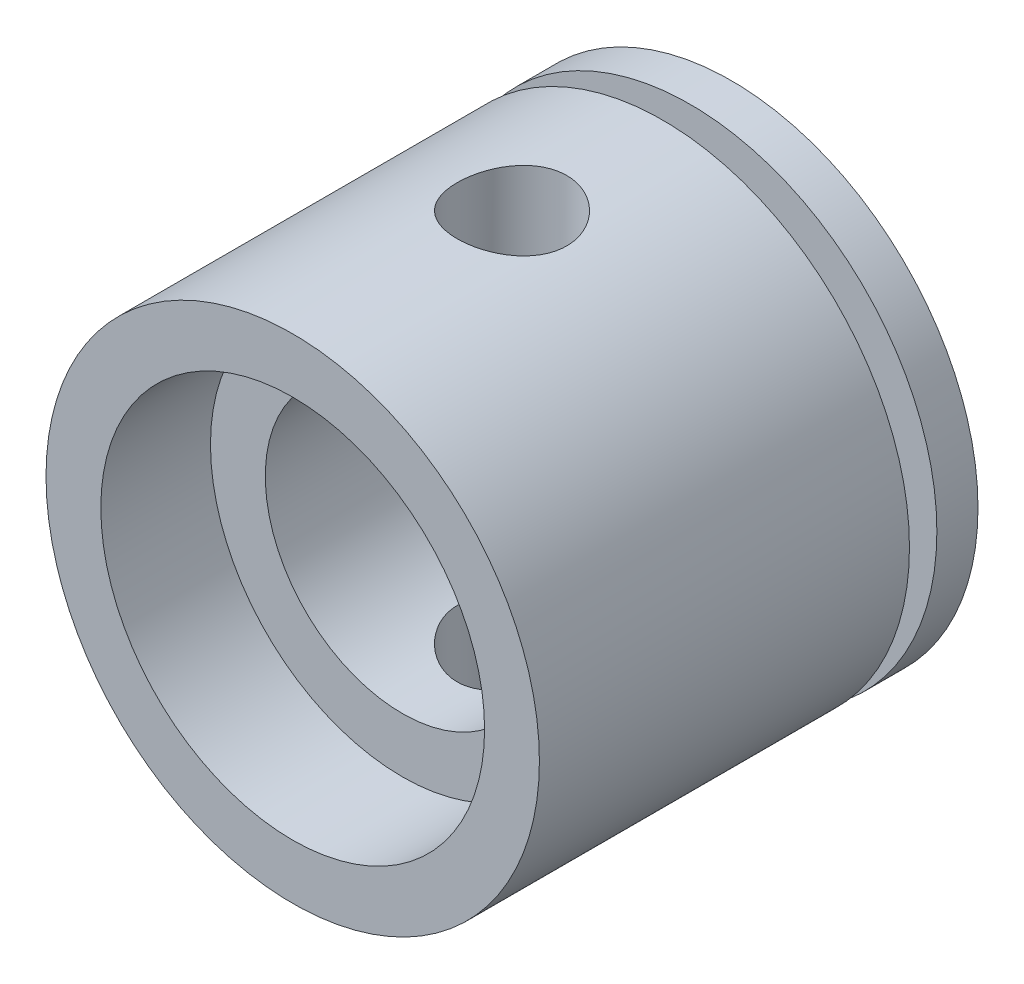
ISO-10303-21;
HEADER;
FILE_DESCRIPTION(('STEP AP214'),'2;1');
FILE_NAME('part.step','',(''),(''),'','','');
FILE_SCHEMA(('AUTOMOTIVE_DESIGN { 1 0 10303 214 1 1 1 1 }'));
ENDSEC;
DATA;
#1=APPLICATION_CONTEXT('core data for automotive mechanical design processes');
#2=APPLICATION_PROTOCOL_DEFINITION('international standard','automotive_design',2000,#1);
#3=PRODUCT_CONTEXT('',#1,'mechanical');
#4=PRODUCT('Part','Part','',(#3));
#5=PRODUCT_RELATED_PRODUCT_CATEGORY('part','',(#4));
#6=PRODUCT_DEFINITION_FORMATION('','',#4);
#7=PRODUCT_DEFINITION_CONTEXT('part definition',#1,'design');
#8=PRODUCT_DEFINITION('design','',#6,#7);
#9=PRODUCT_DEFINITION_SHAPE('','',#8);
#10=(LENGTH_UNIT() NAMED_UNIT(*) SI_UNIT(.MILLI.,.METRE.));
#11=(NAMED_UNIT(*) PLANE_ANGLE_UNIT() SI_UNIT($,.RADIAN.));
#12=(NAMED_UNIT(*) SI_UNIT($,.STERADIAN.) SOLID_ANGLE_UNIT());
#13=UNCERTAINTY_MEASURE_WITH_UNIT(LENGTH_MEASURE(1.E-05),#10,'distance_accuracy_value','');
#14=(GEOMETRIC_REPRESENTATION_CONTEXT(3) GLOBAL_UNCERTAINTY_ASSIGNED_CONTEXT((#13)) GLOBAL_UNIT_ASSIGNED_CONTEXT((#10,
#11,#12)) REPRESENTATION_CONTEXT('',''));
#15=CARTESIAN_POINT('',(0.,0.,0.));
#16=DIRECTION('',(0.,0.,1.));
#17=DIRECTION('',(1.,0.,0.));
#18=AXIS2_PLACEMENT_3D('',#15,#16,#17);
#19=CARTESIAN_POINT('',(0.,0.,16.));
#20=DIRECTION('',(0.,0.,-1.));
#21=DIRECTION('',(-1.,0.,0.));
#22=AXIS2_PLACEMENT_3D('',#19,#20,#21);
#23=CYLINDRICAL_SURFACE('',#22,9.);
#24=CARTESIAN_POINT('',(0.,-9.,10.));
#25=CARTESIAN_POINT('',(0.110880476775648,-8.99999796218252,9.99999627632018));
#26=CARTESIAN_POINT('',(0.22180556526962,-8.99793013995692,9.99074801833651));
#27=CARTESIAN_POINT('',(0.440501944103134,-8.9898809775767,9.95403952764945));
#28=CARTESIAN_POINT('',(0.548270975138987,-8.98389690217348,9.92656656599071));
#29=CARTESIAN_POINT('',(0.757463277761528,-8.96868113169008,9.85431402950835));
#30=CARTESIAN_POINT('',(0.858893152100284,-8.95945288439083,9.80955282300213));
#31=CARTESIAN_POINT('',(1.05280018031376,-8.93874335441378,9.7040533875276));
#32=CARTESIAN_POINT('',(1.14527750793335,-8.92726211547358,9.64331546870939));
#33=CARTESIAN_POINT('',(1.32018631401403,-8.9030909417421,9.50652433489332));
#34=CARTESIAN_POINT('',(1.40244861204353,-8.89038561641427,9.43025749786486));
#35=CARTESIAN_POINT('',(1.55312491045837,-8.86530601079787,9.26503193990686));
#36=CARTESIAN_POINT('',(1.62153764410855,-8.85293176088049,9.17607205928954));
#37=CARTESIAN_POINT('',(1.7433244341035,-8.82976328261711,8.9867281559417));
#38=CARTESIAN_POINT('',(1.79651742104403,-8.81898875742981,8.88622504195847));
#39=CARTESIAN_POINT('',(1.88519298954508,-8.80046096352395,8.67742723830758));
#40=CARTESIAN_POINT('',(1.92067776220096,-8.79270732104771,8.56913351449575));
#41=CARTESIAN_POINT('',(1.97236858006404,-8.78125609459189,8.34966652267734));
#42=CARTESIAN_POINT('',(1.98887467038069,-8.77749545807783,8.23856728489457));
#43=CARTESIAN_POINT('',(2.00307270997673,-8.77426673730669,8.0151177822138));
#44=CARTESIAN_POINT('',(2.00076704911663,-8.77479810778939,7.90276767803785));
#45=CARTESIAN_POINT('',(1.97764827517302,-8.78003632148146,7.6822433728062));
#46=CARTESIAN_POINT('',(1.95718464460217,-8.78466431384841,7.57403037586066));
#47=CARTESIAN_POINT('',(1.89888490681146,-8.79744954191676,7.362612856675));
#48=CARTESIAN_POINT('',(1.86104779681652,-8.80560698133176,7.2594086239146));
#49=CARTESIAN_POINT('',(1.76875672872875,-8.82460909970296,7.05996056161812));
#50=CARTESIAN_POINT('',(1.71416919379353,-8.8354752436249,6.96378067266393));
#51=CARTESIAN_POINT('',(1.5900206813985,-8.85865737910744,6.78181712948411));
#52=CARTESIAN_POINT('',(1.52045760074274,-8.87097357420597,6.69603493817985));
#53=CARTESIAN_POINT('',(1.36648683702983,-8.89600574612666,6.53529069065153));
#54=CARTESIAN_POINT('',(1.28178220526623,-8.90872450687872,6.46061321489494));
#55=CARTESIAN_POINT('',(1.10090661809162,-8.93287839122317,6.32647627109288));
#56=CARTESIAN_POINT('',(1.00473544183737,-8.94431349008427,6.2670170962181));
#57=CARTESIAN_POINT('',(0.803303190734735,-8.96465064233607,6.16493072422319));
#58=CARTESIAN_POINT('',(0.698022122319854,-8.97354693007659,6.12234175569174));
#59=CARTESIAN_POINT('',(0.481555930981457,-8.98776136366255,6.05553898694213));
#60=CARTESIAN_POINT('',(0.370371697593366,-8.99308004696785,6.03132242658587));
#61=CARTESIAN_POINT('',(0.147695483280845,-8.99946317761673,6.00236798674483));
#62=CARTESIAN_POINT('',(0.0362563973189056,-9.0006124862229,5.99724149983832));
#63=CARTESIAN_POINT('',(-0.185885923928079,-8.99876558650597,6.00555810426037));
#64=CARTESIAN_POINT('',(-0.296589210270645,-8.9957696689046,6.01899989331945));
#65=CARTESIAN_POINT('',(-0.512823257329421,-8.98602258758613,6.0637494151681));
#66=CARTESIAN_POINT('',(-0.618398491715483,-8.97931447007761,6.09485245622345));
#67=CARTESIAN_POINT('',(-0.822832805855831,-8.96289421086795,6.17381368744508));
#68=CARTESIAN_POINT('',(-0.921691300010177,-8.95318180764659,6.22167333630601));
#69=CARTESIAN_POINT('',(-1.11148643989438,-8.9316215322764,6.33359287679898));
#70=CARTESIAN_POINT('',(-1.20228573083225,-8.91974444590247,6.39787994300616));
#71=CARTESIAN_POINT('',(-1.37194696498812,-8.8952303234908,6.54053124910144));
#72=CARTESIAN_POINT('',(-1.45080730173413,-8.88259318550175,6.6188973803321));
#73=CARTESIAN_POINT('',(-1.59589548190985,-8.8576887894581,6.7892680335807));
#74=CARTESIAN_POINT('',(-1.66185381940073,-8.84543317664284,6.8815040900066));
#75=CARTESIAN_POINT('',(-1.77734611922752,-8.82295395378309,7.07597203441081));
#76=CARTESIAN_POINT('',(-1.82688079926974,-8.8127302549527,7.1782034853421));
#77=CARTESIAN_POINT('',(-1.90778001896259,-8.79557200548926,7.38920828910514));
#78=CARTESIAN_POINT('',(-1.93924786354759,-8.78861879659787,7.49794044226884));
#79=CARTESIAN_POINT('',(-1.98342027658406,-8.77875649697392,7.71932418486247));
#80=CARTESIAN_POINT('',(-1.99612795718356,-8.77584673547331,7.83197512102595));
#81=CARTESIAN_POINT('',(-2.00228356641044,-8.77444401448977,8.05527887827833));
#82=CARTESIAN_POINT('',(-1.99615913143933,-8.77585298370124,8.16591950806006));
#83=CARTESIAN_POINT('',(-1.96578277121688,-8.78270664957547,8.38454970996682));
#84=CARTESIAN_POINT('',(-1.94153107400239,-8.78815129547033,8.49253931542348));
#85=CARTESIAN_POINT('',(-1.87579819980744,-8.80241428131525,8.70244912022738));
#86=CARTESIAN_POINT('',(-1.83438116628454,-8.81122005182769,8.80439031688159));
#87=CARTESIAN_POINT('',(-1.73554770348342,-8.83121764469058,8.99993999254673));
#88=CARTESIAN_POINT('',(-1.67812954585194,-8.84240972476633,9.09354756996401));
#89=CARTESIAN_POINT('',(-1.54751358990558,-8.8662104283533,9.27187660894797));
#90=CARTESIAN_POINT('',(-1.47401185511038,-8.8788437136774,9.35637220492265));
#91=CARTESIAN_POINT('',(-1.31392870594504,-8.90393974173387,9.51197007393133));
#92=CARTESIAN_POINT('',(-1.22734426623344,-8.91640244429053,9.58306924050841));
#93=CARTESIAN_POINT('',(-1.04214597064557,-8.93995259726581,9.71077598291992));
#94=CARTESIAN_POINT('',(-0.943385636634949,-8.95101923499229,9.76717519973493));
#95=CARTESIAN_POINT('',(-0.737560279778818,-8.97032058369249,9.86248330418121));
#96=CARTESIAN_POINT('',(-0.630502203312995,-8.97855763270815,9.90140664004617));
#97=CARTESIAN_POINT('',(-0.436138247729409,-8.98982812909554,9.95384135027679));
#98=CARTESIAN_POINT('',(-0.349871991901681,-8.9936186902321,9.97111737366629));
#99=CARTESIAN_POINT('',(-0.175746449894528,-8.99870537459789,9.99419790430615));
#100=CARTESIAN_POINT('',(-0.087887238892878,-9.00000161523613,10.0000029515019));
#101=CARTESIAN_POINT('',(0.,-9.,10.));
#102=B_SPLINE_CURVE_WITH_KNOTS('',3,(#24,#25,#26,#27,#28,#29,#30,#31,#32,#33,#34,#35,#36,#37,
#38,#39,#40,#41,#42,#43,#44,#45,#46,#47,#48,#49,#50,#51,#52,#53,#54,#55,#56,#57,#58,#59,#60,#61,
#62,#63,#64,#65,#66,#67,#68,#69,#70,#71,#72,#73,#74,#75,#76,#77,#78,#79,#80,#81,#82,#83,#84,#85,
#86,#87,#88,#89,#90,#91,#92,#93,#94,#95,#96,#97,#98,#99,#100,#101),.UNSPECIFIED.,.T.,.F.,(4,2,2,
2,2,2,2,2,2,2,2,2,2,2,2,2,2,2,2,2,2,2,2,2,2,2,2,2,2,2,2,2,2,2,2,2,2,2,4),(0.,0.332319689729797,
0.664871731249283,0.997071412407458,1.32926464516989,1.66638072002079,2.00352761490514,
2.34453296297976,2.6854961068774,3.02099125638107,3.35644378496591,3.68557668145783,
4.0147285774694,4.34657669709581,4.678471452583,5.01778179808977,5.35709867969827,
5.69718012811237,6.03721047501988,6.37027992124269,6.70332600912267,7.03258869425167,
7.36188004945459,7.69599803262041,8.03016093387756,8.37069473105728,8.71121364510411,
9.04976559055244,9.38826136686411,9.71912785142416,10.0499901738286,10.3796271201578,
10.7092996858639,11.0458432631282,11.3824647846641,11.7236258704957,12.0645043787094,
12.3279234735856,12.5913301688795),.UNSPECIFIED.);
#103=CARTESIAN_POINT('',(0.,-9.,10.));
#104=VERTEX_POINT('',#103);
#105=EDGE_CURVE('E77',#104,#104,#102,.T.);
#106=ORIENTED_EDGE('',*,*,#105,.T.);
#107=EDGE_LOOP('',(#106));
#108=FACE_BOUND('',#107,.T.);
#109=CARTESIAN_POINT('',(0.,9.,10.));
#110=CARTESIAN_POINT('',(-0.110880476775648,8.99999796218252,9.99999627632018));
#111=CARTESIAN_POINT('',(-0.22180556526962,8.99793013995692,9.99074801833651));
#112=CARTESIAN_POINT('',(-0.440501944103134,8.9898809775767,9.95403952764945));
#113=CARTESIAN_POINT('',(-0.548270975138987,8.98389690217348,9.92656656599071));
#114=CARTESIAN_POINT('',(-0.757463277761528,8.96868113169008,9.85431402950835));
#115=CARTESIAN_POINT('',(-0.858893152100284,8.95945288439083,9.80955282300213));
#116=CARTESIAN_POINT('',(-1.05280018031376,8.93874335441378,9.7040533875276));
#117=CARTESIAN_POINT('',(-1.14527750793335,8.92726211547358,9.64331546870939));
#118=CARTESIAN_POINT('',(-1.32018631401403,8.9030909417421,9.50652433489332));
#119=CARTESIAN_POINT('',(-1.40244861204353,8.89038561641427,9.43025749786486));
#120=CARTESIAN_POINT('',(-1.55312491045837,8.86530601079787,9.26503193990686));
#121=CARTESIAN_POINT('',(-1.62153764410855,8.85293176088049,9.17607205928954));
#122=CARTESIAN_POINT('',(-1.7433244341035,8.82976328261711,8.9867281559417));
#123=CARTESIAN_POINT('',(-1.79651742104403,8.81898875742981,8.88622504195847));
#124=CARTESIAN_POINT('',(-1.88519298954508,8.80046096352395,8.67742723830758));
#125=CARTESIAN_POINT('',(-1.92067776220096,8.79270732104771,8.56913351449575));
#126=CARTESIAN_POINT('',(-1.97236858006404,8.78125609459189,8.34966652267734));
#127=CARTESIAN_POINT('',(-1.98887467038069,8.77749545807783,8.23856728489457));
#128=CARTESIAN_POINT('',(-2.00307270997673,8.77426673730669,8.0151177822138));
#129=CARTESIAN_POINT('',(-2.00076704911663,8.77479810778939,7.90276767803785));
#130=CARTESIAN_POINT('',(-1.97764827517302,8.78003632148146,7.6822433728062));
#131=CARTESIAN_POINT('',(-1.95718464460217,8.78466431384841,7.57403037586066));
#132=CARTESIAN_POINT('',(-1.89888490681146,8.79744954191676,7.362612856675));
#133=CARTESIAN_POINT('',(-1.86104779681652,8.80560698133176,7.2594086239146));
#134=CARTESIAN_POINT('',(-1.76875672872875,8.82460909970296,7.05996056161812));
#135=CARTESIAN_POINT('',(-1.71416919379353,8.8354752436249,6.96378067266393));
#136=CARTESIAN_POINT('',(-1.5900206813985,8.85865737910744,6.78181712948411));
#137=CARTESIAN_POINT('',(-1.52045760074274,8.87097357420597,6.69603493817985));
#138=CARTESIAN_POINT('',(-1.36648683702983,8.89600574612666,6.53529069065153));
#139=CARTESIAN_POINT('',(-1.28178220526623,8.90872450687872,6.46061321489494));
#140=CARTESIAN_POINT('',(-1.10090661809162,8.93287839122317,6.32647627109288));
#141=CARTESIAN_POINT('',(-1.00473544183737,8.94431349008427,6.2670170962181));
#142=CARTESIAN_POINT('',(-0.803303190734735,8.96465064233607,6.16493072422319));
#143=CARTESIAN_POINT('',(-0.698022122319854,8.97354693007659,6.12234175569174));
#144=CARTESIAN_POINT('',(-0.481555930981457,8.98776136366255,6.05553898694213));
#145=CARTESIAN_POINT('',(-0.370371697593366,8.99308004696785,6.03132242658587));
#146=CARTESIAN_POINT('',(-0.147695483280845,8.99946317761673,6.00236798674483));
#147=CARTESIAN_POINT('',(-0.0362563973189056,9.0006124862229,5.99724149983832));
#148=CARTESIAN_POINT('',(0.185885923928079,8.99876558650597,6.00555810426037));
#149=CARTESIAN_POINT('',(0.296589210270645,8.9957696689046,6.01899989331945));
#150=CARTESIAN_POINT('',(0.512823257329421,8.98602258758613,6.0637494151681));
#151=CARTESIAN_POINT('',(0.618398491715483,8.97931447007761,6.09485245622345));
#152=CARTESIAN_POINT('',(0.822832805855831,8.96289421086795,6.17381368744508));
#153=CARTESIAN_POINT('',(0.921691300010177,8.95318180764659,6.22167333630601));
#154=CARTESIAN_POINT('',(1.11148643989438,8.9316215322764,6.33359287679898));
#155=CARTESIAN_POINT('',(1.20228573083225,8.91974444590247,6.39787994300616));
#156=CARTESIAN_POINT('',(1.37194696498812,8.8952303234908,6.54053124910144));
#157=CARTESIAN_POINT('',(1.45080730173413,8.88259318550175,6.6188973803321));
#158=CARTESIAN_POINT('',(1.59589548190985,8.8576887894581,6.7892680335807));
#159=CARTESIAN_POINT('',(1.66185381940073,8.84543317664284,6.8815040900066));
#160=CARTESIAN_POINT('',(1.77734611922752,8.82295395378309,7.07597203441081));
#161=CARTESIAN_POINT('',(1.82688079926974,8.8127302549527,7.1782034853421));
#162=CARTESIAN_POINT('',(1.90778001896259,8.79557200548926,7.38920828910514));
#163=CARTESIAN_POINT('',(1.93924786354759,8.78861879659787,7.49794044226884));
#164=CARTESIAN_POINT('',(1.98342027658406,8.77875649697392,7.71932418486247));
#165=CARTESIAN_POINT('',(1.99612795718356,8.77584673547331,7.83197512102595));
#166=CARTESIAN_POINT('',(2.00228356641044,8.77444401448977,8.05527887827833));
#167=CARTESIAN_POINT('',(1.99615913143933,8.77585298370124,8.16591950806006));
#168=CARTESIAN_POINT('',(1.96578277121688,8.78270664957547,8.38454970996682));
#169=CARTESIAN_POINT('',(1.94153107400239,8.78815129547033,8.49253931542348));
#170=CARTESIAN_POINT('',(1.87579819980744,8.80241428131525,8.70244912022738));
#171=CARTESIAN_POINT('',(1.83438116628454,8.81122005182769,8.80439031688159));
#172=CARTESIAN_POINT('',(1.73554770348342,8.83121764469058,8.99993999254673));
#173=CARTESIAN_POINT('',(1.67812954585194,8.84240972476633,9.09354756996401));
#174=CARTESIAN_POINT('',(1.54751358990558,8.8662104283533,9.27187660894797));
#175=CARTESIAN_POINT('',(1.47401185511038,8.8788437136774,9.35637220492265));
#176=CARTESIAN_POINT('',(1.31392870594504,8.90393974173387,9.51197007393133));
#177=CARTESIAN_POINT('',(1.22734426623344,8.91640244429053,9.58306924050841));
#178=CARTESIAN_POINT('',(1.04214597064557,8.93995259726581,9.71077598291992));
#179=CARTESIAN_POINT('',(0.943385636634949,8.95101923499229,9.76717519973493));
#180=CARTESIAN_POINT('',(0.737560279778818,8.97032058369249,9.86248330418121));
#181=CARTESIAN_POINT('',(0.630502203312995,8.97855763270815,9.90140664004617));
#182=CARTESIAN_POINT('',(0.436138247729409,8.98982812909554,9.95384135027679));
#183=CARTESIAN_POINT('',(0.349871991901681,8.9936186902321,9.97111737366629));
#184=CARTESIAN_POINT('',(0.175746449894528,8.99870537459789,9.99419790430615));
#185=CARTESIAN_POINT('',(0.087887238892878,9.00000161523613,10.0000029515019));
#186=CARTESIAN_POINT('',(0.,9.,10.));
#187=B_SPLINE_CURVE_WITH_KNOTS('',3,(#109,#110,#111,#112,#113,#114,#115,#116,#117,#118,#119,
#120,#121,#122,#123,#124,#125,#126,#127,#128,#129,#130,#131,#132,#133,#134,#135,#136,#137,#138,
#139,#140,#141,#142,#143,#144,#145,#146,#147,#148,#149,#150,#151,#152,#153,#154,#155,#156,#157,
#158,#159,#160,#161,#162,#163,#164,#165,#166,#167,#168,#169,#170,#171,#172,#173,#174,#175,#176,
#177,#178,#179,#180,#181,#182,#183,#184,#185,#186),.UNSPECIFIED.,.T.,.F.,(4,2,2,2,2,2,2,2,2,2,2,
2,2,2,2,2,2,2,2,2,2,2,2,2,2,2,2,2,2,2,2,2,2,2,2,2,2,2,4),(0.,0.332319689729797,
0.664871731249283,0.997071412407458,1.32926464516989,1.66638072002079,2.00352761490514,
2.34453296297976,2.6854961068774,3.02099125638107,3.35644378496591,3.68557668145783,
4.0147285774694,4.34657669709581,4.678471452583,5.01778179808977,5.35709867969827,
5.69718012811237,6.03721047501988,6.37027992124269,6.70332600912267,7.03258869425167,
7.36188004945459,7.69599803262041,8.03016093387756,8.37069473105728,8.71121364510411,
9.04976559055244,9.38826136686411,9.71912785142416,10.0499901738286,10.3796271201578,
10.7092996858639,11.0458432631282,11.3824647846641,11.7236258704957,12.0645043787094,
12.3279234735856,12.5913301688795),.UNSPECIFIED.);
#188=CARTESIAN_POINT('',(0.,9.,10.));
#189=VERTEX_POINT('',#188);
#190=EDGE_CURVE('E73',#189,#189,#187,.T.);
#191=ORIENTED_EDGE('',*,*,#190,.T.);
#192=EDGE_LOOP('',(#191));
#193=FACE_BOUND('',#192,.T.);
#194=CARTESIAN_POINT('',(0.,0.,2.5));
#195=DIRECTION('',(0.,0.,1.));
#196=DIRECTION('',(1.,0.,0.));
#197=AXIS2_PLACEMENT_3D('',#194,#195,#196);
#198=CIRCLE('',#197,9.);
#199=CARTESIAN_POINT('',(9.,0.,2.5));
#200=VERTEX_POINT('',#199);
#201=EDGE_CURVE('E86',#200,#200,#198,.T.);
#202=ORIENTED_EDGE('',*,*,#201,.T.);
#203=EDGE_LOOP('',(#202));
#204=FACE_BOUND('',#203,.T.);
#205=CARTESIAN_POINT('',(0.,0.,16.));
#206=DIRECTION('',(0.,0.,1.));
#207=DIRECTION('',(1.,0.,0.));
#208=AXIS2_PLACEMENT_3D('',#205,#206,#207);
#209=CIRCLE('',#208,9.);
#210=CARTESIAN_POINT('',(9.,0.,16.));
#211=VERTEX_POINT('',#210);
#212=EDGE_CURVE('E10',#211,#211,#209,.T.);
#213=ORIENTED_EDGE('',*,*,#212,.F.);
#214=EDGE_LOOP('',(#213));
#215=FACE_BOUND('',#214,.T.);
#216=ADVANCED_FACE('F31',(#108,#193,#204,#215),#23,.T.);
#217=CARTESIAN_POINT('',(0.,0.,16.));
#218=DIRECTION('',(0.,0.,1.));
#219=DIRECTION('',(1.,0.,0.));
#220=AXIS2_PLACEMENT_3D('',#217,#218,#219);
#221=PLANE('',#220);
#222=CARTESIAN_POINT('',(0.,0.,16.));
#223=DIRECTION('',(0.,0.,1.));
#224=DIRECTION('',(1.,0.,0.));
#225=AXIS2_PLACEMENT_3D('',#222,#223,#224);
#226=CIRCLE('',#225,7.);
#227=CARTESIAN_POINT('',(7.,0.,16.));
#228=VERTEX_POINT('',#227);
#229=EDGE_CURVE('E92',#228,#228,#226,.T.);
#230=ORIENTED_EDGE('',*,*,#229,.F.);
#231=EDGE_LOOP('',(#230));
#232=FACE_BOUND('',#231,.T.);
#233=ORIENTED_EDGE('',*,*,#212,.T.);
#234=EDGE_LOOP('',(#233));
#235=FACE_BOUND('',#234,.T.);
#236=ADVANCED_FACE('F117',(#232,#235),#221,.T.);
#237=CARTESIAN_POINT('',(0.,0.,2.));
#238=DIRECTION('',(0.,0.,-1.));
#239=DIRECTION('',(-1.,0.,0.));
#240=AXIS2_PLACEMENT_3D('',#237,#238,#239);
#241=PLANE('',#240);
#242=CARTESIAN_POINT('',(0.,0.,2.));
#243=DIRECTION('',(0.,0.,1.));
#244=DIRECTION('',(1.,0.,0.));
#245=AXIS2_PLACEMENT_3D('',#242,#243,#244);
#246=CIRCLE('',#245,5.);
#247=CARTESIAN_POINT('',(5.,0.,2.));
#248=VERTEX_POINT('',#247);
#249=EDGE_CURVE('E48',#248,#248,#246,.T.);
#250=ORIENTED_EDGE('',*,*,#249,.T.);
#251=EDGE_LOOP('',(#250));
#252=FACE_BOUND('',#251,.T.);
#253=ADVANCED_FACE('F106',(#252),#241,.F.);
#254=CARTESIAN_POINT('',(0.,0.,16.));
#255=DIRECTION('',(0.,0.,1.));
#256=DIRECTION('',(1.,0.,0.));
#257=AXIS2_PLACEMENT_3D('',#254,#255,#256);
#258=CYLINDRICAL_SURFACE('',#257,5.);
#259=CARTESIAN_POINT('',(0.,-5.,10.));
#260=CARTESIAN_POINT('',(-0.107493005442891,-4.99999271227084,9.99999014817627));
#261=CARTESIAN_POINT('',(-0.215172564090673,-4.99649294306932,9.99128224791162));
#262=CARTESIAN_POINT('',(-0.427496480417896,-4.98283453100641,9.95675229647876));
#263=CARTESIAN_POINT('',(-0.532131777561248,-4.97265778698877,9.93088372091387));
#264=CARTESIAN_POINT('',(-0.734953922727403,-4.94674209213118,9.86312392194117));
#265=CARTESIAN_POINT('',(-0.833160661616958,-4.93102136364072,9.82128515378327));
#266=CARTESIAN_POINT('',(-1.02107197032837,-4.89556610796078,9.72298082667345));
#267=CARTESIAN_POINT('',(-1.11077947675099,-4.87583297458056,9.66652034508107));
#268=CARTESIAN_POINT('',(-1.28350100757039,-4.83330886170418,9.53776450143906));
#269=CARTESIAN_POINT('',(-1.36606227255021,-4.8104229692919,9.46489334375974));
#270=CARTESIAN_POINT('',(-1.51817500478472,-4.76460576906194,9.30659999652322));
#271=CARTESIAN_POINT('',(-1.58772010713353,-4.74167444453792,9.22117170278826));
#272=CARTESIAN_POINT('',(-1.71487456729288,-4.69722791797136,9.03557192975773));
#273=CARTESIAN_POINT('',(-1.77181498119547,-4.67582115964951,8.9349135139768));
#274=CARTESIAN_POINT('',(-1.86775471903715,-4.63833647186792,8.72446360157996));
#275=CARTESIAN_POINT('',(-1.90676256428583,-4.62225601244176,8.61467647215164));
#276=CARTESIAN_POINT('',(-1.96389882339587,-4.59826357660818,8.3942876664079));
#277=CARTESIAN_POINT('',(-1.98289396580565,-4.59001420355605,8.28394876442379));
#278=CARTESIAN_POINT('',(-2.00217296164003,-4.58164004049144,8.06136500169273));
#279=CARTESIAN_POINT('',(-2.00246601631322,-4.58151125522768,7.94912110537499));
#280=CARTESIAN_POINT('',(-1.98498936750454,-4.58910500279994,7.73424332854196));
#281=CARTESIAN_POINT('',(-1.96847531430514,-4.5962817503845,7.63148428559097));
#282=CARTESIAN_POINT('',(-1.91994688029782,-4.61676187607836,7.43034044399329));
#283=CARTESIAN_POINT('',(-1.88792979480463,-4.63006632321673,7.33195641188969));
#284=CARTESIAN_POINT('',(-1.80869473255107,-4.6615948508853,7.13998216380396));
#285=CARTESIAN_POINT('',(-1.76117986231532,-4.67991379280787,7.04653076094531));
#286=CARTESIAN_POINT('',(-1.65250646073221,-4.7193811638989,6.86858418363844));
#287=CARTESIAN_POINT('',(-1.59134280510084,-4.74053065456848,6.78409239059719));
#288=CARTESIAN_POINT('',(-1.45155059945443,-4.7852673674227,6.619590271198));
#289=CARTESIAN_POINT('',(-1.37193746297064,-4.80891664976151,6.54043127055398));
#290=CARTESIAN_POINT('',(-1.20031442743019,-4.85459824958282,6.39631552199796));
#291=CARTESIAN_POINT('',(-1.10830206533443,-4.87663024445324,6.33136160258971));
#292=CARTESIAN_POINT('',(-0.912077652605844,-4.91714681264548,6.21638255258417));
#293=CARTESIAN_POINT('',(-0.807660491346478,-4.93555270095414,6.16667771880295));
#294=CARTESIAN_POINT('',(-0.591023765482883,-4.96614828328759,6.08583213892194));
#295=CARTESIAN_POINT('',(-0.478808196849675,-4.97834113462382,6.05468196244259));
#296=CARTESIAN_POINT('',(-0.256895887607821,-4.9945613950691,6.0135517045803));
#297=CARTESIAN_POINT('',(-0.147443293985535,-4.99902945833514,6.00242754574644));
#298=CARTESIAN_POINT('',(0.0718453098078166,-5.00068478510631,5.99828689947139));
#299=CARTESIAN_POINT('',(0.181681213223923,-4.99787393582291,6.00526571845249));
#300=CARTESIAN_POINT('',(0.393432739121987,-4.98557567063753,6.03629175255199));
#301=CARTESIAN_POINT('',(0.495482491775474,-4.97639391345523,6.05955798035098));
#302=CARTESIAN_POINT('',(0.69413542806078,-4.952594414055,6.12143570830981));
#303=CARTESIAN_POINT('',(0.790737910224844,-4.9379759735653,6.16004917966868));
#304=CARTESIAN_POINT('',(0.979078785816702,-4.90416594770811,6.25278493967995));
#305=CARTESIAN_POINT('',(1.07057802275541,-4.88484815979803,6.30734547204315));
#306=CARTESIAN_POINT('',(1.24344359124655,-4.84373364745524,6.42994032390564));
#307=CARTESIAN_POINT('',(1.32480584076112,-4.8219359311027,6.49798004292261));
#308=CARTESIAN_POINT('',(1.48072304302882,-4.77645117638112,6.65087001294963));
#309=CARTESIAN_POINT('',(1.55447393380606,-4.75273441425052,6.73653354150621));
#310=CARTESIAN_POINT('',(1.68675119741371,-4.70741672917132,6.91944008300937));
#311=CARTESIAN_POINT('',(1.74527506133751,-4.68581615526511,7.01668500033995));
#312=CARTESIAN_POINT('',(1.84580750193163,-4.64714299907708,7.2214616945941));
#313=CARTESIAN_POINT('',(1.88765059453445,-4.63011630884787,7.32908399921231));
#314=CARTESIAN_POINT('',(1.9522962197053,-4.60323673477931,7.55073365171516));
#315=CARTESIAN_POINT('',(1.97511280526931,-4.59337855695998,7.66475620581243));
#316=CARTESIAN_POINT('',(1.9997156172784,-4.58271759299926,7.88712790177454));
#317=CARTESIAN_POINT('',(2.00289708230287,-4.58131421008171,7.99529483959335));
#318=CARTESIAN_POINT('',(1.99180315927752,-4.58614836033097,8.21054485771329));
#319=CARTESIAN_POINT('',(1.97752998791378,-4.59238492324793,8.31762807390258));
#320=CARTESIAN_POINT('',(1.93307136615365,-4.6112664907902,8.52333218985504));
#321=CARTESIAN_POINT('',(1.90353749357098,-4.62364831827449,8.622120274433));
#322=CARTESIAN_POINT('',(1.83000544849101,-4.65324001232696,8.81337862961348));
#323=CARTESIAN_POINT('',(1.78600328139381,-4.67045121206006,8.90584714689982));
#324=CARTESIAN_POINT('',(1.68187276275973,-4.70898609604491,9.08760961927078));
#325=CARTESIAN_POINT('',(1.62096533515949,-4.73048882313242,9.17641867013048));
#326=CARTESIAN_POINT('',(1.4858921192715,-4.77463804372237,9.34299331720375));
#327=CARTESIAN_POINT('',(1.41172233481812,-4.79728488048406,9.42075557212831));
#328=CARTESIAN_POINT('',(1.24650550627246,-4.84293567087394,9.56820285326361));
#329=CARTESIAN_POINT('',(1.15467600114614,-4.86586757962185,9.63703730689807));
#330=CARTESIAN_POINT('',(0.959900320285781,-4.90800406713716,9.75833704262163));
#331=CARTESIAN_POINT('',(0.856949004547239,-4.92720691092906,9.81079471215253));
#332=CARTESIAN_POINT('',(0.644738062495204,-4.95939714815861,9.89662221519029));
#333=CARTESIAN_POINT('',(0.535631618219697,-4.97249363055028,9.93032932356034));
#334=CARTESIAN_POINT('',(0.312876546281222,-4.99144306209365,9.97863912095427));
#335=CARTESIAN_POINT('',(0.199243525858914,-4.99731899495637,9.9933024367439));
#336=CARTESIAN_POINT('',(0.0569122978909302,-4.99975899504136,9.99939538097827));
#337=CARTESIAN_POINT('',(0.0284626887407586,-5.00000192969175,10.0000026086292));
#338=CARTESIAN_POINT('',(0.,-5.,10.));
#339=B_SPLINE_CURVE_WITH_KNOTS('',3,(#259,#260,#261,#262,#263,#264,#265,#266,#267,#268,#269,
#270,#271,#272,#273,#274,#275,#276,#277,#278,#279,#280,#281,#282,#283,#284,#285,#286,#287,#288,
#289,#290,#291,#292,#293,#294,#295,#296,#297,#298,#299,#300,#301,#302,#303,#304,#305,#306,#307,
#308,#309,#310,#311,#312,#313,#314,#315,#316,#317,#318,#319,#320,#321,#322,#323,#324,#325,#326,
#327,#328,#329,#330,#331,#332,#333,#334,#335,#336,#337,#338),.UNSPECIFIED.,.T.,.F.,(4,2,2,2,2,2,
2,2,2,2,2,2,2,2,2,2,2,2,2,2,2,2,2,2,2,2,2,2,2,2,2,2,2,2,2,2,2,2,2,4),(0.,0.322402987893071,
0.645683636007934,0.96791145747158,1.29002753567984,1.62597381700397,1.96208394934411,
2.31315258819217,2.66405423118268,2.99904105308829,3.33386306340488,3.64538328401372,
3.95695787256047,4.27489126298816,4.59294421938183,4.93558349186557,5.27829092839733,
5.62776913162806,5.9770695611379,6.30569184528007,6.63422893570082,6.94800455564365,
7.26182048993796,7.58523513398262,7.90877959498969,8.25368474624413,8.59864669043748,
8.94695045140827,9.29499672645933,9.61799673392748,9.94095572563045,10.2511431854877,
10.5614163580516,10.8894546805669,11.2175920134839,11.5670042353384,11.9165786364053,
12.2596430101332,12.6016125240434,12.686980458968),.UNSPECIFIED.);
#340=CARTESIAN_POINT('',(0.,-5.,10.));
#341=VERTEX_POINT('',#340);
#342=EDGE_CURVE('E35',#341,#341,#339,.T.);
#343=ORIENTED_EDGE('',*,*,#342,.T.);
#344=EDGE_LOOP('',(#343));
#345=FACE_BOUND('',#344,.T.);
#346=CARTESIAN_POINT('',(0.,5.,10.));
#347=CARTESIAN_POINT('',(0.107493005442891,4.99999271227084,9.99999014817627));
#348=CARTESIAN_POINT('',(0.215172564090673,4.99649294306932,9.99128224791162));
#349=CARTESIAN_POINT('',(0.427496480417896,4.98283453100641,9.95675229647876));
#350=CARTESIAN_POINT('',(0.532131777561248,4.97265778698877,9.93088372091387));
#351=CARTESIAN_POINT('',(0.734953922727403,4.94674209213118,9.86312392194117));
#352=CARTESIAN_POINT('',(0.833160661616958,4.93102136364072,9.82128515378327));
#353=CARTESIAN_POINT('',(1.02107197032837,4.89556610796078,9.72298082667345));
#354=CARTESIAN_POINT('',(1.11077947675099,4.87583297458056,9.66652034508107));
#355=CARTESIAN_POINT('',(1.28350100757039,4.83330886170418,9.53776450143906));
#356=CARTESIAN_POINT('',(1.36606227255021,4.8104229692919,9.46489334375974));
#357=CARTESIAN_POINT('',(1.51817500478472,4.76460576906194,9.30659999652322));
#358=CARTESIAN_POINT('',(1.58772010713353,4.74167444453792,9.22117170278826));
#359=CARTESIAN_POINT('',(1.71487456729288,4.69722791797136,9.03557192975773));
#360=CARTESIAN_POINT('',(1.77181498119547,4.67582115964951,8.9349135139768));
#361=CARTESIAN_POINT('',(1.86775471903715,4.63833647186792,8.72446360157996));
#362=CARTESIAN_POINT('',(1.90676256428583,4.62225601244176,8.61467647215164));
#363=CARTESIAN_POINT('',(1.96389882339587,4.59826357660818,8.3942876664079));
#364=CARTESIAN_POINT('',(1.98289396580565,4.59001420355605,8.28394876442379));
#365=CARTESIAN_POINT('',(2.00217296164003,4.58164004049144,8.06136500169273));
#366=CARTESIAN_POINT('',(2.00246601631322,4.58151125522768,7.94912110537499));
#367=CARTESIAN_POINT('',(1.98498936750454,4.58910500279994,7.73424332854196));
#368=CARTESIAN_POINT('',(1.96847531430514,4.5962817503845,7.63148428559097));
#369=CARTESIAN_POINT('',(1.91994688029782,4.61676187607836,7.43034044399329));
#370=CARTESIAN_POINT('',(1.88792979480463,4.63006632321673,7.33195641188969));
#371=CARTESIAN_POINT('',(1.80869473255107,4.6615948508853,7.13998216380396));
#372=CARTESIAN_POINT('',(1.76117986231532,4.67991379280787,7.04653076094531));
#373=CARTESIAN_POINT('',(1.65250646073221,4.7193811638989,6.86858418363844));
#374=CARTESIAN_POINT('',(1.59134280510084,4.74053065456848,6.78409239059719));
#375=CARTESIAN_POINT('',(1.45155059945443,4.7852673674227,6.619590271198));
#376=CARTESIAN_POINT('',(1.37193746297064,4.80891664976151,6.54043127055398));
#377=CARTESIAN_POINT('',(1.20031442743019,4.85459824958282,6.39631552199796));
#378=CARTESIAN_POINT('',(1.10830206533443,4.87663024445324,6.33136160258971));
#379=CARTESIAN_POINT('',(0.912077652605844,4.91714681264548,6.21638255258417));
#380=CARTESIAN_POINT('',(0.807660491346478,4.93555270095414,6.16667771880295));
#381=CARTESIAN_POINT('',(0.591023765482883,4.96614828328759,6.08583213892194));
#382=CARTESIAN_POINT('',(0.478808196849675,4.97834113462382,6.05468196244259));
#383=CARTESIAN_POINT('',(0.256895887607821,4.9945613950691,6.0135517045803));
#384=CARTESIAN_POINT('',(0.147443293985535,4.99902945833514,6.00242754574644));
#385=CARTESIAN_POINT('',(-0.0718453098078166,5.00068478510631,5.99828689947139));
#386=CARTESIAN_POINT('',(-0.181681213223923,4.99787393582291,6.00526571845249));
#387=CARTESIAN_POINT('',(-0.393432739121987,4.98557567063753,6.03629175255199));
#388=CARTESIAN_POINT('',(-0.495482491775474,4.97639391345523,6.05955798035098));
#389=CARTESIAN_POINT('',(-0.69413542806078,4.952594414055,6.12143570830981));
#390=CARTESIAN_POINT('',(-0.790737910224844,4.9379759735653,6.16004917966868));
#391=CARTESIAN_POINT('',(-0.979078785816702,4.90416594770811,6.25278493967995));
#392=CARTESIAN_POINT('',(-1.07057802275541,4.88484815979803,6.30734547204315));
#393=CARTESIAN_POINT('',(-1.24344359124655,4.84373364745524,6.42994032390564));
#394=CARTESIAN_POINT('',(-1.32480584076112,4.8219359311027,6.49798004292261));
#395=CARTESIAN_POINT('',(-1.48072304302882,4.77645117638112,6.65087001294963));
#396=CARTESIAN_POINT('',(-1.55447393380606,4.75273441425052,6.73653354150621));
#397=CARTESIAN_POINT('',(-1.68675119741371,4.70741672917132,6.91944008300937));
#398=CARTESIAN_POINT('',(-1.74527506133751,4.68581615526511,7.01668500033995));
#399=CARTESIAN_POINT('',(-1.84580750193163,4.64714299907708,7.2214616945941));
#400=CARTESIAN_POINT('',(-1.88765059453445,4.63011630884787,7.32908399921231));
#401=CARTESIAN_POINT('',(-1.9522962197053,4.60323673477931,7.55073365171516));
#402=CARTESIAN_POINT('',(-1.97511280526931,4.59337855695998,7.66475620581243));
#403=CARTESIAN_POINT('',(-1.9997156172784,4.58271759299926,7.88712790177454));
#404=CARTESIAN_POINT('',(-2.00289708230287,4.58131421008171,7.99529483959335));
#405=CARTESIAN_POINT('',(-1.99180315927752,4.58614836033097,8.21054485771329));
#406=CARTESIAN_POINT('',(-1.97752998791378,4.59238492324793,8.31762807390258));
#407=CARTESIAN_POINT('',(-1.93307136615365,4.6112664907902,8.52333218985504));
#408=CARTESIAN_POINT('',(-1.90353749357098,4.62364831827449,8.622120274433));
#409=CARTESIAN_POINT('',(-1.83000544849101,4.65324001232696,8.81337862961348));
#410=CARTESIAN_POINT('',(-1.78600328139381,4.67045121206006,8.90584714689982));
#411=CARTESIAN_POINT('',(-1.68187276275973,4.70898609604491,9.08760961927078));
#412=CARTESIAN_POINT('',(-1.62096533515949,4.73048882313242,9.17641867013048));
#413=CARTESIAN_POINT('',(-1.4858921192715,4.77463804372237,9.34299331720375));
#414=CARTESIAN_POINT('',(-1.41172233481812,4.79728488048406,9.42075557212831));
#415=CARTESIAN_POINT('',(-1.24650550627246,4.84293567087394,9.56820285326361));
#416=CARTESIAN_POINT('',(-1.15467600114614,4.86586757962185,9.63703730689807));
#417=CARTESIAN_POINT('',(-0.959900320285781,4.90800406713716,9.75833704262163));
#418=CARTESIAN_POINT('',(-0.856949004547239,4.92720691092906,9.81079471215253));
#419=CARTESIAN_POINT('',(-0.644738062495204,4.95939714815861,9.89662221519029));
#420=CARTESIAN_POINT('',(-0.535631618219697,4.97249363055028,9.93032932356034));
#421=CARTESIAN_POINT('',(-0.312876546281222,4.99144306209365,9.97863912095427));
#422=CARTESIAN_POINT('',(-0.199243525858914,4.99731899495637,9.9933024367439));
#423=CARTESIAN_POINT('',(-0.0569122978909302,4.99975899504136,9.99939538097827));
#424=CARTESIAN_POINT('',(-0.0284626887407586,5.00000192969175,10.0000026086292));
#425=CARTESIAN_POINT('',(0.,5.,10.));
#426=B_SPLINE_CURVE_WITH_KNOTS('',3,(#346,#347,#348,#349,#350,#351,#352,#353,#354,#355,#356,
#357,#358,#359,#360,#361,#362,#363,#364,#365,#366,#367,#368,#369,#370,#371,#372,#373,#374,#375,
#376,#377,#378,#379,#380,#381,#382,#383,#384,#385,#386,#387,#388,#389,#390,#391,#392,#393,#394,
#395,#396,#397,#398,#399,#400,#401,#402,#403,#404,#405,#406,#407,#408,#409,#410,#411,#412,#413,
#414,#415,#416,#417,#418,#419,#420,#421,#422,#423,#424,#425),.UNSPECIFIED.,.T.,.F.,(4,2,2,2,2,2,
2,2,2,2,2,2,2,2,2,2,2,2,2,2,2,2,2,2,2,2,2,2,2,2,2,2,2,2,2,2,2,2,2,4),(0.,0.322402987893071,
0.645683636007934,0.96791145747158,1.29002753567984,1.62597381700397,1.96208394934411,
2.31315258819217,2.66405423118268,2.99904105308829,3.33386306340488,3.64538328401372,
3.95695787256047,4.27489126298816,4.59294421938183,4.93558349186557,5.27829092839733,
5.62776913162806,5.9770695611379,6.30569184528007,6.63422893570082,6.94800455564365,
7.26182048993796,7.58523513398262,7.90877959498969,8.25368474624413,8.59864669043748,
8.94695045140827,9.29499672645933,9.61799673392748,9.94095572563045,10.2511431854877,
10.5614163580516,10.8894546805669,11.2175920134839,11.5670042353384,11.9165786364053,
12.2596430101332,12.6016125240434,12.686980458968),.UNSPECIFIED.);
#427=CARTESIAN_POINT('',(0.,5.,10.));
#428=VERTEX_POINT('',#427);
#429=EDGE_CURVE('E52',#428,#428,#426,.T.);
#430=ORIENTED_EDGE('',*,*,#429,.T.);
#431=EDGE_LOOP('',(#430));
#432=FACE_BOUND('',#431,.T.);
#433=ORIENTED_EDGE('',*,*,#249,.F.);
#434=EDGE_LOOP('',(#433));
#435=FACE_BOUND('',#434,.T.);
#436=CARTESIAN_POINT('',(0.,0.,12.));
#437=DIRECTION('',(0.,0.,1.));
#438=DIRECTION('',(1.,0.,0.));
#439=AXIS2_PLACEMENT_3D('',#436,#437,#438);
#440=CIRCLE('',#439,5.);
#441=CARTESIAN_POINT('',(5.,0.,12.));
#442=VERTEX_POINT('',#441);
#443=EDGE_CURVE('E99',#442,#442,#440,.T.);
#444=ORIENTED_EDGE('',*,*,#443,.T.);
#445=EDGE_LOOP('',(#444));
#446=FACE_BOUND('',#445,.T.);
#447=ADVANCED_FACE('F56',(#345,#432,#435,#446),#258,.F.);
#448=CARTESIAN_POINT('',(5.,0.,12.));
#449=DIRECTION('',(0.,0.,-1.));
#450=DIRECTION('',(-1.,0.,0.));
#451=AXIS2_PLACEMENT_3D('',#448,#449,#450);
#452=PLANE('',#451);
#453=ORIENTED_EDGE('',*,*,#443,.F.);
#454=EDGE_LOOP('',(#453));
#455=FACE_BOUND('',#454,.T.);
#456=CARTESIAN_POINT('',(0.,0.,12.));
#457=DIRECTION('',(0.,0.,1.));
#458=DIRECTION('',(1.,0.,0.));
#459=AXIS2_PLACEMENT_3D('',#456,#457,#458);
#460=CIRCLE('',#459,7.);
#461=CARTESIAN_POINT('',(7.,0.,12.));
#462=VERTEX_POINT('',#461);
#463=EDGE_CURVE('E97',#462,#462,#460,.T.);
#464=ORIENTED_EDGE('',*,*,#463,.T.);
#465=EDGE_LOOP('',(#464));
#466=FACE_BOUND('',#465,.T.);
#467=ADVANCED_FACE('F109',(#455,#466),#452,.F.);
#468=CARTESIAN_POINT('',(0.,0.,16.));
#469=DIRECTION('',(0.,0.,1.));
#470=DIRECTION('',(1.,0.,0.));
#471=AXIS2_PLACEMENT_3D('',#468,#469,#470);
#472=CYLINDRICAL_SURFACE('',#471,7.);
#473=ORIENTED_EDGE('',*,*,#463,.F.);
#474=EDGE_LOOP('',(#473));
#475=FACE_BOUND('',#474,.T.);
#476=ORIENTED_EDGE('',*,*,#229,.T.);
#477=EDGE_LOOP('',(#476));
#478=FACE_BOUND('',#477,.T.);
#479=ADVANCED_FACE('F115',(#475,#478),#472,.F.);
#480=CARTESIAN_POINT('',(0.,0.,1.5));
#481=DIRECTION('',(0.,0.,1.));
#482=DIRECTION('',(1.,0.,0.));
#483=AXIS2_PLACEMENT_3D('',#480,#481,#482);
#484=PLANE('',#483);
#485=CARTESIAN_POINT('',(0.,0.,1.5));
#486=DIRECTION('',(0.,0.,1.));
#487=DIRECTION('',(1.,0.,0.));
#488=AXIS2_PLACEMENT_3D('',#485,#486,#487);
#489=CIRCLE('',#488,7.5);
#490=CARTESIAN_POINT('',(7.5,0.,1.5));
#491=VERTEX_POINT('',#490);
#492=EDGE_CURVE('E83',#491,#491,#489,.T.);
#493=ORIENTED_EDGE('',*,*,#492,.F.);
#494=EDGE_LOOP('',(#493));
#495=FACE_BOUND('',#494,.T.);
#496=CARTESIAN_POINT('',(0.,0.,1.5));
#497=DIRECTION('',(0.,0.,1.));
#498=DIRECTION('',(1.,0.,0.));
#499=AXIS2_PLACEMENT_3D('',#496,#497,#498);
#500=CIRCLE('',#499,9.);
#501=CARTESIAN_POINT('',(9.,0.,1.5));
#502=VERTEX_POINT('',#501);
#503=EDGE_CURVE('E89',#502,#502,#500,.T.);
#504=ORIENTED_EDGE('',*,*,#503,.T.);
#505=EDGE_LOOP('',(#504));
#506=FACE_BOUND('',#505,.T.);
#507=ADVANCED_FACE('F142',(#495,#506),#484,.T.);
#508=CARTESIAN_POINT('',(0.,0.,2.5));
#509=DIRECTION('',(0.,0.,1.));
#510=DIRECTION('',(1.,0.,0.));
#511=AXIS2_PLACEMENT_3D('',#508,#509,#510);
#512=PLANE('',#511);
#513=CARTESIAN_POINT('',(0.,0.,2.5));
#514=DIRECTION('',(0.,0.,1.));
#515=DIRECTION('',(1.,0.,0.));
#516=AXIS2_PLACEMENT_3D('',#513,#514,#515);
#517=CIRCLE('',#516,7.5);
#518=CARTESIAN_POINT('',(7.5,0.,2.5));
#519=VERTEX_POINT('',#518);
#520=EDGE_CURVE('E82',#519,#519,#517,.T.);
#521=ORIENTED_EDGE('',*,*,#520,.T.);
#522=EDGE_LOOP('',(#521));
#523=FACE_BOUND('',#522,.T.);
#524=ORIENTED_EDGE('',*,*,#201,.F.);
#525=EDGE_LOOP('',(#524));
#526=FACE_BOUND('',#525,.T.);
#527=ADVANCED_FACE('F144',(#523,#526),#512,.F.);
#528=CARTESIAN_POINT('',(0.,0.,1.5));
#529=DIRECTION('',(0.,0.,1.));
#530=DIRECTION('',(1.,0.,0.));
#531=AXIS2_PLACEMENT_3D('',#528,#529,#530);
#532=CYLINDRICAL_SURFACE('',#531,7.5);
#533=ORIENTED_EDGE('',*,*,#492,.T.);
#534=EDGE_LOOP('',(#533));
#535=FACE_BOUND('',#534,.T.);
#536=ORIENTED_EDGE('',*,*,#520,.F.);
#537=EDGE_LOOP('',(#536));
#538=FACE_BOUND('',#537,.T.);
#539=ADVANCED_FACE('F66',(#535,#538),#532,.T.);
#540=CARTESIAN_POINT('',(0.,0.,0.));
#541=DIRECTION('',(0.,0.,1.));
#542=DIRECTION('',(1.,0.,0.));
#543=AXIS2_PLACEMENT_3D('',#540,#541,#542);
#544=PLANE('',#543);
#545=CARTESIAN_POINT('',(0.,0.,0.));
#546=DIRECTION('',(0.,0.,1.));
#547=DIRECTION('',(1.,0.,0.));
#548=AXIS2_PLACEMENT_3D('',#545,#546,#547);
#549=CIRCLE('',#548,9.);
#550=CARTESIAN_POINT('',(9.,0.,0.));
#551=VERTEX_POINT('',#550);
#552=EDGE_CURVE('E43',#551,#551,#549,.T.);
#553=ORIENTED_EDGE('',*,*,#552,.F.);
#554=EDGE_LOOP('',(#553));
#555=FACE_BOUND('',#554,.T.);
#556=ADVANCED_FACE('F130',(#555),#544,.F.);
#557=ORIENTED_EDGE('',*,*,#552,.T.);
#558=EDGE_LOOP('',(#557));
#559=FACE_BOUND('',#558,.T.);
#560=ORIENTED_EDGE('',*,*,#503,.F.);
#561=EDGE_LOOP('',(#560));
#562=FACE_BOUND('',#561,.T.);
#563=ADVANCED_FACE('F122',(#559,#562),#23,.T.);
#564=CARTESIAN_POINT('',(0.,-15.5,8.));
#565=DIRECTION('',(0.,1.,0.));
#566=DIRECTION('',(0.,0.,1.));
#567=AXIS2_PLACEMENT_3D('',#564,#565,#566);
#568=CYLINDRICAL_SURFACE('',#567,2.);
#569=ORIENTED_EDGE('',*,*,#429,.F.);
#570=EDGE_LOOP('',(#569));
#571=FACE_BOUND('',#570,.T.);
#572=ORIENTED_EDGE('',*,*,#190,.F.);
#573=EDGE_LOOP('',(#572));
#574=FACE_BOUND('',#573,.T.);
#575=ADVANCED_FACE('F64',(#571,#574),#568,.F.);
#576=ORIENTED_EDGE('',*,*,#342,.F.);
#577=EDGE_LOOP('',(#576));
#578=FACE_BOUND('',#577,.T.);
#579=ORIENTED_EDGE('',*,*,#105,.F.);
#580=EDGE_LOOP('',(#579));
#581=FACE_BOUND('',#580,.T.);
#582=ADVANCED_FACE('F60',(#578,#581),#568,.F.);
#583=CLOSED_SHELL('',(#216,#236,#253,#447,#467,#479,#507,#527,#539,#556,#563,#575,#582));
#584=MANIFOLD_SOLID_BREP('B2',#583);
#585=ADVANCED_BREP_SHAPE_REPRESENTATION('',(#18,#584),#14);
#586=SHAPE_DEFINITION_REPRESENTATION(#9,#585);
ENDSEC;
END-ISO-10303-21;
